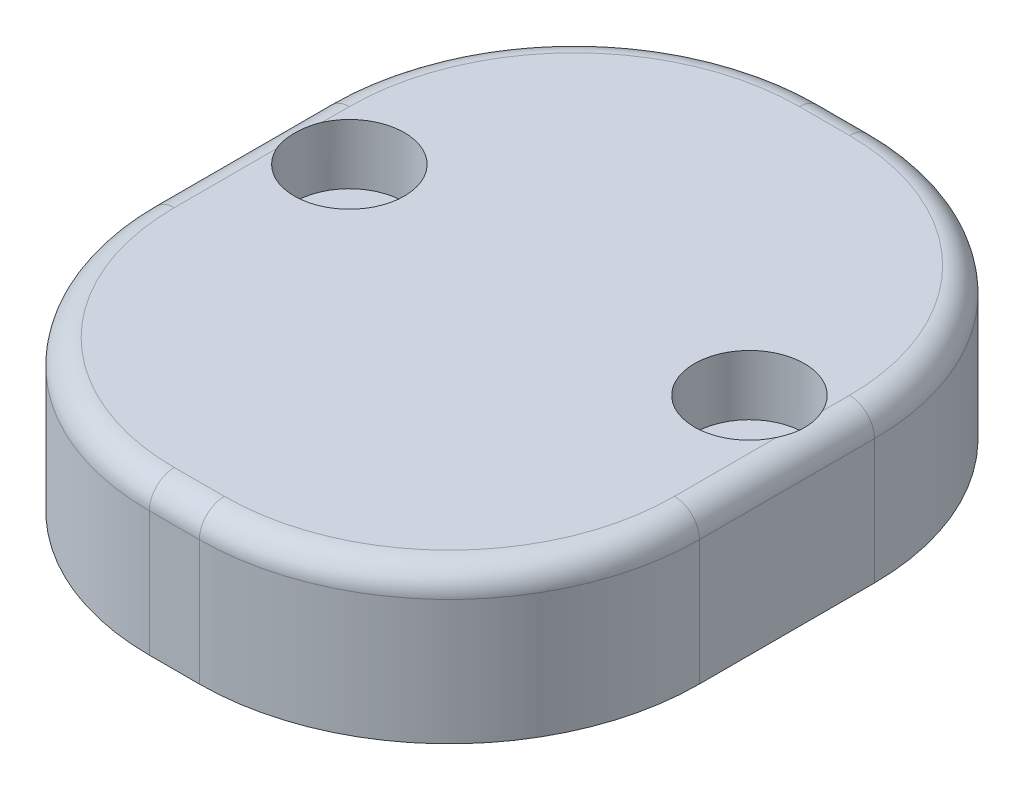
ISO-10303-21;
HEADER;
FILE_DESCRIPTION(('STEP AP214'),'2;1');
FILE_NAME('part.step','',(''),(''),'','','');
FILE_SCHEMA(('AUTOMOTIVE_DESIGN { 1 0 10303 214 1 1 1 1 }'));
ENDSEC;
DATA;
#1=APPLICATION_CONTEXT('core data for automotive mechanical design processes');
#2=APPLICATION_PROTOCOL_DEFINITION('international standard','automotive_design',2000,#1);
#3=PRODUCT_CONTEXT('',#1,'mechanical');
#4=PRODUCT('Part','Part','',(#3));
#5=PRODUCT_RELATED_PRODUCT_CATEGORY('part','',(#4));
#6=PRODUCT_DEFINITION_FORMATION('','',#4);
#7=PRODUCT_DEFINITION_CONTEXT('part definition',#1,'design');
#8=PRODUCT_DEFINITION('design','',#6,#7);
#9=PRODUCT_DEFINITION_SHAPE('','',#8);
#10=(LENGTH_UNIT() NAMED_UNIT(*) SI_UNIT(.MILLI.,.METRE.));
#11=(NAMED_UNIT(*) PLANE_ANGLE_UNIT() SI_UNIT($,.RADIAN.));
#12=(NAMED_UNIT(*) SI_UNIT($,.STERADIAN.) SOLID_ANGLE_UNIT());
#13=UNCERTAINTY_MEASURE_WITH_UNIT(LENGTH_MEASURE(1.E-05),#10,'distance_accuracy_value','');
#14=(GEOMETRIC_REPRESENTATION_CONTEXT(3) GLOBAL_UNCERTAINTY_ASSIGNED_CONTEXT((#13)) GLOBAL_UNIT_ASSIGNED_CONTEXT((#10,
#11,#12)) REPRESENTATION_CONTEXT('',''));
#15=CARTESIAN_POINT('',(0.,0.,0.));
#16=DIRECTION('',(0.,0.,1.));
#17=DIRECTION('',(1.,0.,0.));
#18=AXIS2_PLACEMENT_3D('',#15,#16,#17);
#19=CARTESIAN_POINT('',(0.,0.,0.));
#20=DIRECTION('',(0.,0.,1.));
#21=DIRECTION('',(1.,0.,0.));
#22=AXIS2_PLACEMENT_3D('',#19,#20,#21);
#23=PLANE('',#22);
#24=DIRECTION('',(0.,1.,0.));
#25=VECTOR('',#24,1.);
#26=CARTESIAN_POINT('',(10.,6.,0.));
#27=LINE('',#26,#25);
#28=CARTESIAN_POINT('',(10.,4.89897948556636,0.));
#29=VERTEX_POINT('',#28);
#30=CARTESIAN_POINT('',(10.,5.,0.));
#31=VERTEX_POINT('',#30);
#32=EDGE_CURVE('E191',#29,#31,#27,.T.);
#33=ORIENTED_EDGE('',*,*,#32,.T.);
#34=DIRECTION('',(1.,0.,0.));
#35=VECTOR('',#34,1.);
#36=CARTESIAN_POINT('',(12.,5.,0.));
#37=LINE('',#36,#35);
#38=CARTESIAN_POINT('',(11.,5.,0.));
#39=VERTEX_POINT('',#38);
#40=EDGE_CURVE('E271',#31,#39,#37,.T.);
#41=ORIENTED_EDGE('',*,*,#40,.T.);
#42=CARTESIAN_POINT('',(11.,0.,0.));
#43=DIRECTION('',(0.,0.,1.));
#44=DIRECTION('',(1.,0.,0.));
#45=AXIS2_PLACEMENT_3D('',#42,#43,#44);
#46=CIRCLE('',#45,5.);
#47=EDGE_CURVE('E168',#29,#39,#46,.F.);
#48=ORIENTED_EDGE('',*,*,#47,.F.);
#49=EDGE_LOOP('',(#33,#41,#48));
#50=FACE_BOUND('',#49,.T.);
#51=ADVANCED_FACE('F32',(#50),#23,.F.);
#52=CARTESIAN_POINT('',(11.,0.,22.));
#53=DIRECTION('',(0.,0.,-1.));
#54=DIRECTION('',(-1.,0.,0.));
#55=AXIS2_PLACEMENT_3D('',#52,#53,#54);
#56=CYLINDRICAL_SURFACE('',#55,5.);
#57=DIRECTION('',(0.,0.,-1.));
#58=VECTOR('',#57,1.);
#59=CARTESIAN_POINT('',(6.,0.,22.));
#60=LINE('',#59,#58);
#61=CARTESIAN_POINT('',(6.,0.,22.));
#62=VERTEX_POINT('',#61);
#63=CARTESIAN_POINT('',(6.,0.,0.834848610088321));
#64=VERTEX_POINT('',#63);
#65=EDGE_CURVE('E160',#62,#64,#60,.T.);
#66=ORIENTED_EDGE('',*,*,#65,.T.);
#67=CARTESIAN_POINT('',(6.,0.,0.834848610088321));
#68=CARTESIAN_POINT('',(5.99997867187738,0.135011845033446,0.834882018948806));
#69=CARTESIAN_POINT('',(6.00546746244243,0.270010557183533,0.832463030257463));
#70=CARTESIAN_POINT('',(6.0273036116272,0.538906984847514,0.82296657021474));
#71=CARTESIAN_POINT('',(6.04364641369319,0.672805138510441,0.815891053702076));
#72=CARTESIAN_POINT('',(6.08694176524044,0.93800536106932,0.79736486598689));
#73=CARTESIAN_POINT('',(6.11385130062064,1.06931571634541,0.785931938020787));
#74=CARTESIAN_POINT('',(6.17799889048549,1.32898103097825,0.759138461814082));
#75=CARTESIAN_POINT('',(6.21523768152985,1.45733577886905,0.743777633488427));
#76=CARTESIAN_POINT('',(6.2996412162674,1.71007289707297,0.709714282724713));
#77=CARTESIAN_POINT('',(6.34679151482346,1.83446074821384,0.691016629336118));
#78=CARTESIAN_POINT('',(6.45066344419621,2.07874315416516,0.650919566211288));
#79=CARTESIAN_POINT('',(6.50738867032313,2.19863600039304,0.629519142368764));
#80=CARTESIAN_POINT('',(6.69138039763596,2.55065991663144,0.562302920265389));
#81=CARTESIAN_POINT('',(6.83246766867098,2.77515039770592,0.513470148602644));
#82=CARTESIAN_POINT('',(7.1564694231924,3.21008706511323,0.411226797712404));
#83=CARTESIAN_POINT('',(7.34120934875028,3.41915137620118,0.357710877119809));
#84=CARTESIAN_POINT('',(7.64283316769946,3.70794894262942,0.281225043641196));
#85=CARTESIAN_POINT('',(7.74755685338337,3.80014759496294,0.256342104162777));
#86=CARTESIAN_POINT('',(7.96462514598613,3.97567035613554,0.208699057654279));
#87=CARTESIAN_POINT('',(8.07696676447299,4.05899791241655,0.185938126410237));
#88=CARTESIAN_POINT('',(8.31112881266445,4.21786973870763,0.142911601921965));
#89=CARTESIAN_POINT('',(8.43310154925899,4.29320706490404,0.122710511282571));
#90=CARTESIAN_POINT('',(8.68347126805493,4.43331222756631,0.0862347494353322));
#91=CARTESIAN_POINT('',(8.81186521516233,4.49808499699451,0.0699582439928226));
#92=CARTESIAN_POINT('',(9.07387178505899,4.61634532323629,0.0421084282489397));
#93=CARTESIAN_POINT('',(9.20747142306811,4.66985906491516,0.0305241459201425));
#94=CARTESIAN_POINT('',(9.47903775417308,4.76522326674506,0.0126539151737671));
#95=CARTESIAN_POINT('',(9.61700084044304,4.80708309321236,0.0063637036076295));
#96=CARTESIAN_POINT('',(9.79687154728861,4.85326917813204,0.00198147055236757));
#97=CARTESIAN_POINT('',(9.83735341458672,4.86312562393378,0.00124020583946215));
#98=CARTESIAN_POINT('',(9.91852063678993,4.88181658890864,0.000249786474286768));
#99=CARTESIAN_POINT('',(9.95920577997313,4.89065200450769,1.97011901891483E-07));
#100=CARTESIAN_POINT('',(10.,4.89897948556636,0.));
#101=B_SPLINE_CURVE_WITH_KNOTS('',3,(#67,#68,#69,#70,#71,#72,#73,#74,#75,#76,#77,#78,#79,#80,
#81,#82,#83,#84,#85,#86,#87,#88,#89,#90,#91,#92,#93,#94,#95,#96,#97,#98,#99,#100),.UNSPECIFIED.,
.F.,.F.,(4,2,2,2,2,2,2,2,2,2,2,2,2,2,2,2,4),(0.,0.404881690591231,0.809593517715284,
1.21267468031032,1.6157845932544,2.01831103288909,2.42098895565289,3.22630049164659,
4.07444094444146,4.49921419060271,4.92382175621481,5.35759888778723,5.79117289011644,
6.22372711209933,6.65593267760133,6.78093528552342,6.90582729841),.UNSPECIFIED.);
#102=EDGE_CURVE('E213',#64,#29,#101,.T.);
#103=ORIENTED_EDGE('',*,*,#102,.T.);
#104=ORIENTED_EDGE('',*,*,#47,.T.);
#105=CARTESIAN_POINT('',(12.,4.89897948556636,0.));
#106=VERTEX_POINT('',#105);
#107=EDGE_CURVE('E176',#39,#106,#46,.F.);
#108=ORIENTED_EDGE('',*,*,#107,.T.);
#109=CARTESIAN_POINT('',(12.,4.89897948556636,0.));
#110=CARTESIAN_POINT('',(12.1322032583834,4.87201440791222,-2.14329301021152E-05));
#111=CARTESIAN_POINT('',(12.2632817786647,4.83966390255237,0.0026210772666264));
#112=CARTESIAN_POINT('',(12.5221637065431,4.76456920101274,0.012807986322809));
#113=CARTESIAN_POINT('',(12.6499687294982,4.72183024482699,0.0203499170843514));
#114=CARTESIAN_POINT('',(12.9009022287471,4.62650199462219,0.039870763241075));
#115=CARTESIAN_POINT('',(13.0240475964267,4.57395342911886,0.0518315261982716));
#116=CARTESIAN_POINT('',(13.265360329098,4.45937262791172,0.0796352779055718));
#117=CARTESIAN_POINT('',(13.3835272001646,4.39733945403671,0.0954786507980635));
#118=CARTESIAN_POINT('',(13.7290562348091,4.19794694565129,0.147872954381521));
#119=CARTESIAN_POINT('',(13.9480606298654,4.04705970582392,0.189340943626381));
#120=CARTESIAN_POINT('',(14.3586104835474,3.71347505726727,0.279847902943476));
#121=CARTESIAN_POINT('',(14.550127808398,3.53074547451764,0.328894524855925));
#122=CARTESIAN_POINT('',(14.9118890352833,3.12647082880639,0.431394504019483));
#123=CARTESIAN_POINT('',(15.0803032775626,2.90330913059372,0.484939834020765));
#124=CARTESIAN_POINT('',(15.3782195431659,2.43086293163413,0.586576785252228));
#125=CARTESIAN_POINT('',(15.5077030843076,2.1815660988498,0.634665809400884));
#126=CARTESIAN_POINT('',(15.6705504775165,1.79065148045435,0.697823053148833));
#127=CARTESIAN_POINT('',(15.719898856655,1.65623845449805,0.717513784014776));
#128=CARTESIAN_POINT('',(15.8069961070902,1.38321419059191,0.752892259267276));
#129=CARTESIAN_POINT('',(15.8447503790763,1.24460494045593,0.768581866851002));
#130=CARTESIAN_POINT('',(15.908180059381,0.964546007225919,0.795256124157805));
#131=CARTESIAN_POINT('',(15.9338823337092,0.823103381836048,0.806251233791758));
#132=CARTESIAN_POINT('',(15.9730136005027,0.538297729866727,0.823092907288587));
#133=CARTESIAN_POINT('',(15.9864520818861,0.394936275251337,0.828943451550562));
#134=CARTESIAN_POINT('',(15.9957891902516,0.209406770232198,0.833011982947895));
#135=CARTESIAN_POINT('',(15.9973688350891,0.167521864295987,0.833700727781765));
#136=CARTESIAN_POINT('',(15.9994735454067,0.0837597007614819,0.834618717628923));
#137=CARTESIAN_POINT('',(15.9999995950335,0.0418824725949628,0.834848391452833));
#138=CARTESIAN_POINT('',(16.,0.,0.834848610088265));
#139=B_SPLINE_CURVE_WITH_KNOTS('',3,(#109,#110,#111,#112,#113,#114,#115,#116,#117,#118,#119,
#120,#121,#122,#123,#124,#125,#126,#127,#128,#129,#130,#131,#132,#133,#134,#135,#136,#137,#138),
.UNSPECIFIED.,.F.,.F.,(4,2,2,2,2,2,2,2,2,2,2,2,2,2,4),(0.,0.404599235286033,0.80899481037096,
1.21174728420965,1.61453962216218,2.41817085710597,3.22261885287953,4.07282394175045,
4.92343202678592,5.35655012939949,5.78946617273127,6.22141252807982,6.65302438762456,
6.7787749103284,6.90440791655807),.UNSPECIFIED.);
#140=CARTESIAN_POINT('',(16.,0.,0.834848610088321));
#141=VERTEX_POINT('',#140);
#142=EDGE_CURVE('E156',#106,#141,#139,.T.);
#143=ORIENTED_EDGE('',*,*,#142,.T.);
#144=DIRECTION('',(0.,0.,-1.));
#145=VECTOR('',#144,1.);
#146=CARTESIAN_POINT('',(16.,0.,22.));
#147=LINE('',#146,#145);
#148=CARTESIAN_POINT('',(16.,0.,22.));
#149=VERTEX_POINT('',#148);
#150=EDGE_CURVE('E149',#149,#141,#147,.T.);
#151=ORIENTED_EDGE('',*,*,#150,.F.);
#152=CARTESIAN_POINT('',(11.,0.,22.));
#153=DIRECTION('',(0.,0.,1.));
#154=DIRECTION('',(1.,0.,0.));
#155=AXIS2_PLACEMENT_3D('',#152,#153,#154);
#156=CIRCLE('',#155,5.);
#157=EDGE_CURVE('E153',#62,#149,#156,.F.);
#158=ORIENTED_EDGE('',*,*,#157,.F.);
#159=EDGE_LOOP('',(#66,#103,#104,#108,#143,#151,#158));
#160=FACE_BOUND('',#159,.T.);
#161=ADVANCED_FACE('F152',(#160),#56,.F.);
#162=CARTESIAN_POINT('',(0.,0.,22.));
#163=DIRECTION('',(0.,1.,0.));
#164=DIRECTION('',(0.,0.,1.));
#165=AXIS2_PLACEMENT_3D('',#162,#163,#164);
#166=PLANE('',#165);
#167=CARTESIAN_POINT('',(19.,0.,12.));
#168=DIRECTION('',(0.,1.,0.));
#169=DIRECTION('',(0.,0.,1.));
#170=AXIS2_PLACEMENT_3D('',#167,#168,#169);
#171=CIRCLE('',#170,1.20000000000001);
#172=CARTESIAN_POINT('',(19.,0.,13.2));
#173=VERTEX_POINT('',#172);
#174=EDGE_CURVE('E363',#173,#173,#171,.T.);
#175=ORIENTED_EDGE('',*,*,#174,.T.);
#176=EDGE_LOOP('',(#175));
#177=FACE_BOUND('',#176,.T.);
#178=CARTESIAN_POINT('',(3.,0.,12.));
#179=DIRECTION('',(0.,1.,0.));
#180=DIRECTION('',(0.,0.,1.));
#181=AXIS2_PLACEMENT_3D('',#178,#179,#180);
#182=CIRCLE('',#181,1.20000000000001);
#183=CARTESIAN_POINT('',(3.,0.,13.2));
#184=VERTEX_POINT('',#183);
#185=EDGE_CURVE('E173',#184,#184,#182,.T.);
#186=ORIENTED_EDGE('',*,*,#185,.T.);
#187=EDGE_LOOP('',(#186));
#188=FACE_BOUND('',#187,.T.);
#189=DIRECTION('',(0.,0.,-1.));
#190=VECTOR('',#189,1.);
#191=CARTESIAN_POINT('',(0.,0.,22.));
#192=LINE('',#191,#190);
#193=CARTESIAN_POINT('',(0.,0.,17.));
#194=VERTEX_POINT('',#193);
#195=CARTESIAN_POINT('',(0.,0.,10.));
#196=VERTEX_POINT('',#195);
#197=EDGE_CURVE('E167',#194,#196,#192,.T.);
#198=ORIENTED_EDGE('',*,*,#197,.T.);
#199=CARTESIAN_POINT('',(10.,0.,10.));
#200=DIRECTION('',(0.,1.,0.));
#201=DIRECTION('',(0.,0.,1.));
#202=AXIS2_PLACEMENT_3D('',#199,#200,#201);
#203=CIRCLE('',#202,10.);
#204=EDGE_CURVE('E205',#196,#64,#203,.F.);
#205=ORIENTED_EDGE('',*,*,#204,.T.);
#206=ORIENTED_EDGE('',*,*,#65,.F.);
#207=DIRECTION('',(1.,0.,0.));
#208=VECTOR('',#207,1.);
#209=CARTESIAN_POINT('',(0.,0.,22.));
#210=LINE('',#209,#208);
#211=EDGE_CURVE('E166',#62,#149,#210,.T.);
#212=ORIENTED_EDGE('',*,*,#211,.T.);
#213=ORIENTED_EDGE('',*,*,#150,.T.);
#214=CARTESIAN_POINT('',(12.,0.,10.));
#215=DIRECTION('',(0.,1.,0.));
#216=DIRECTION('',(0.,0.,1.));
#217=AXIS2_PLACEMENT_3D('',#214,#215,#216);
#218=CIRCLE('',#217,10.);
#219=CARTESIAN_POINT('',(22.,0.,10.));
#220=VERTEX_POINT('',#219);
#221=EDGE_CURVE('E201',#141,#220,#218,.F.);
#222=ORIENTED_EDGE('',*,*,#221,.T.);
#223=DIRECTION('',(0.,0.,-1.));
#224=VECTOR('',#223,1.);
#225=CARTESIAN_POINT('',(22.,0.,22.));
#226=LINE('',#225,#224);
#227=CARTESIAN_POINT('',(22.,0.,17.));
#228=VERTEX_POINT('',#227);
#229=EDGE_CURVE('E161',#228,#220,#226,.T.);
#230=ORIENTED_EDGE('',*,*,#229,.F.);
#231=CARTESIAN_POINT('',(12.,0.,17.));
#232=DIRECTION('',(0.,1.,0.));
#233=DIRECTION('',(0.,0.,1.));
#234=AXIS2_PLACEMENT_3D('',#231,#232,#233);
#235=CIRCLE('',#234,10.);
#236=CARTESIAN_POINT('',(12.,0.,27.));
#237=VERTEX_POINT('',#236);
#238=EDGE_CURVE('E199',#228,#237,#235,.F.);
#239=ORIENTED_EDGE('',*,*,#238,.T.);
#240=DIRECTION('',(1.,0.,0.));
#241=VECTOR('',#240,1.);
#242=CARTESIAN_POINT('',(0.,0.,27.));
#243=LINE('',#242,#241);
#244=CARTESIAN_POINT('',(10.,0.,27.));
#245=VERTEX_POINT('',#244);
#246=EDGE_CURVE('E172',#245,#237,#243,.T.);
#247=ORIENTED_EDGE('',*,*,#246,.F.);
#248=CARTESIAN_POINT('',(10.,0.,17.));
#249=DIRECTION('',(0.,1.,0.));
#250=DIRECTION('',(0.,0.,1.));
#251=AXIS2_PLACEMENT_3D('',#248,#249,#250);
#252=CIRCLE('',#251,10.);
#253=EDGE_CURVE('E203',#245,#194,#252,.F.);
#254=ORIENTED_EDGE('',*,*,#253,.T.);
#255=EDGE_LOOP('',(#198,#205,#206,#212,#213,#222,#230,#239,#247,#254));
#256=FACE_BOUND('',#255,.T.);
#257=ADVANCED_FACE('F171',(#177,#188,#256),#166,.F.);
#258=CARTESIAN_POINT('',(22.,0.,22.));
#259=DIRECTION('',(-1.,0.,0.));
#260=DIRECTION('',(0.,0.,1.));
#261=AXIS2_PLACEMENT_3D('',#258,#259,#260);
#262=PLANE('',#261);
#263=DIRECTION('',(0.,1.,0.));
#264=VECTOR('',#263,1.);
#265=CARTESIAN_POINT('',(22.,0.,10.));
#266=LINE('',#265,#264);
#267=CARTESIAN_POINT('',(22.,5.,10.));
#268=VERTEX_POINT('',#267);
#269=EDGE_CURVE('E446',#220,#268,#266,.T.);
#270=ORIENTED_EDGE('',*,*,#269,.T.);
#271=DIRECTION('',(0.,0.,-1.));
#272=VECTOR('',#271,1.);
#273=CARTESIAN_POINT('',(22.,5.,17.));
#274=LINE('',#273,#272);
#275=CARTESIAN_POINT('',(22.,5.,17.));
#276=VERTEX_POINT('',#275);
#277=EDGE_CURVE('E280',#268,#276,#274,.F.);
#278=ORIENTED_EDGE('',*,*,#277,.T.);
#279=DIRECTION('',(0.,1.,0.));
#280=VECTOR('',#279,1.);
#281=CARTESIAN_POINT('',(22.,0.,17.));
#282=LINE('',#281,#280);
#283=EDGE_CURVE('E449',#276,#228,#282,.F.);
#284=ORIENTED_EDGE('',*,*,#283,.T.);
#285=ORIENTED_EDGE('',*,*,#229,.T.);
#286=EDGE_LOOP('',(#270,#278,#284,#285));
#287=FACE_BOUND('',#286,.T.);
#288=ADVANCED_FACE('F434',(#287),#262,.F.);
#289=CARTESIAN_POINT('',(0.,6.,22.));
#290=DIRECTION('',(0.,1.,0.));
#291=DIRECTION('',(0.,0.,1.));
#292=AXIS2_PLACEMENT_3D('',#289,#290,#291);
#293=PLANE('',#292);
#294=CARTESIAN_POINT('',(19.,6.,12.));
#295=DIRECTION('',(0.,1.,0.));
#296=DIRECTION('',(0.,0.,1.));
#297=AXIS2_PLACEMENT_3D('',#294,#295,#296);
#298=CIRCLE('',#297,2.19999999999999);
#299=CARTESIAN_POINT('',(21.,6.,11.0834848610088));
#300=VERTEX_POINT('',#299);
#301=CARTESIAN_POINT('',(21.,6.,12.9165151389912));
#302=VERTEX_POINT('',#301);
#303=EDGE_CURVE('E347',#300,#302,#298,.T.);
#304=ORIENTED_EDGE('',*,*,#303,.F.);
#305=DIRECTION('',(0.,0.,-1.));
#306=VECTOR('',#305,1.);
#307=CARTESIAN_POINT('',(21.,6.,10.));
#308=LINE('',#307,#306);
#309=CARTESIAN_POINT('',(21.,6.,10.));
#310=VERTEX_POINT('',#309);
#311=EDGE_CURVE('E403',#300,#310,#308,.T.);
#312=ORIENTED_EDGE('',*,*,#311,.T.);
#313=CARTESIAN_POINT('',(12.,6.,10.));
#314=DIRECTION('',(0.,1.,0.));
#315=DIRECTION('',(0.,0.,1.));
#316=AXIS2_PLACEMENT_3D('',#313,#314,#315);
#317=CIRCLE('',#316,9.);
#318=CARTESIAN_POINT('',(12.,6.,1.));
#319=VERTEX_POINT('',#318);
#320=EDGE_CURVE('E401',#310,#319,#317,.T.);
#321=ORIENTED_EDGE('',*,*,#320,.T.);
#322=DIRECTION('',(1.,0.,0.));
#323=VECTOR('',#322,1.);
#324=CARTESIAN_POINT('',(10.,6.,1.));
#325=LINE('',#324,#323);
#326=CARTESIAN_POINT('',(10.,6.,1.));
#327=VERTEX_POINT('',#326);
#328=EDGE_CURVE('E399',#319,#327,#325,.F.);
#329=ORIENTED_EDGE('',*,*,#328,.T.);
#330=CARTESIAN_POINT('',(10.,6.,10.));
#331=DIRECTION('',(0.,1.,0.));
#332=DIRECTION('',(0.,0.,1.));
#333=AXIS2_PLACEMENT_3D('',#330,#331,#332);
#334=CIRCLE('',#333,9.);
#335=CARTESIAN_POINT('',(1.,6.,10.));
#336=VERTEX_POINT('',#335);
#337=EDGE_CURVE('E397',#327,#336,#334,.T.);
#338=ORIENTED_EDGE('',*,*,#337,.T.);
#339=DIRECTION('',(0.,0.,-1.));
#340=VECTOR('',#339,1.);
#341=CARTESIAN_POINT('',(1.,6.,22.));
#342=LINE('',#341,#340);
#343=CARTESIAN_POINT('',(1.,6.,11.0834848610088));
#344=VERTEX_POINT('',#343);
#345=EDGE_CURVE('E384',#336,#344,#342,.F.);
#346=ORIENTED_EDGE('',*,*,#345,.T.);
#347=CARTESIAN_POINT('',(3.,6.,12.));
#348=DIRECTION('',(0.,1.,0.));
#349=DIRECTION('',(0.,0.,1.));
#350=AXIS2_PLACEMENT_3D('',#347,#348,#349);
#351=CIRCLE('',#350,2.19999999999999);
#352=CARTESIAN_POINT('',(1.,6.,12.9165151389912));
#353=VERTEX_POINT('',#352);
#354=EDGE_CURVE('E366',#353,#344,#351,.T.);
#355=ORIENTED_EDGE('',*,*,#354,.F.);
#356=DIRECTION('',(0.,0.,-1.));
#357=VECTOR('',#356,1.);
#358=CARTESIAN_POINT('',(1.,6.,22.));
#359=LINE('',#358,#357);
#360=CARTESIAN_POINT('',(1.,6.,17.));
#361=VERTEX_POINT('',#360);
#362=EDGE_CURVE('E385',#353,#361,#359,.F.);
#363=ORIENTED_EDGE('',*,*,#362,.T.);
#364=CARTESIAN_POINT('',(10.,6.,17.));
#365=DIRECTION('',(0.,1.,0.));
#366=DIRECTION('',(0.,0.,1.));
#367=AXIS2_PLACEMENT_3D('',#364,#365,#366);
#368=CIRCLE('',#367,9.);
#369=CARTESIAN_POINT('',(10.,6.,26.));
#370=VERTEX_POINT('',#369);
#371=EDGE_CURVE('E388',#361,#370,#368,.T.);
#372=ORIENTED_EDGE('',*,*,#371,.T.);
#373=DIRECTION('',(-1.,0.,0.));
#374=VECTOR('',#373,1.);
#375=CARTESIAN_POINT('',(12.,6.,26.));
#376=LINE('',#375,#374);
#377=CARTESIAN_POINT('',(12.,6.,26.));
#378=VERTEX_POINT('',#377);
#379=EDGE_CURVE('E392',#370,#378,#376,.F.);
#380=ORIENTED_EDGE('',*,*,#379,.T.);
#381=CARTESIAN_POINT('',(12.,6.,17.));
#382=DIRECTION('',(0.,1.,0.));
#383=DIRECTION('',(0.,0.,1.));
#384=AXIS2_PLACEMENT_3D('',#381,#382,#383);
#385=CIRCLE('',#384,9.);
#386=CARTESIAN_POINT('',(21.,6.,17.));
#387=VERTEX_POINT('',#386);
#388=EDGE_CURVE('E332',#378,#387,#385,.T.);
#389=ORIENTED_EDGE('',*,*,#388,.T.);
#390=DIRECTION('',(0.,0.,-1.));
#391=VECTOR('',#390,1.);
#392=CARTESIAN_POINT('',(21.,6.,10.));
#393=LINE('',#392,#391);
#394=EDGE_CURVE('E387',#387,#302,#393,.T.);
#395=ORIENTED_EDGE('',*,*,#394,.T.);
#396=EDGE_LOOP('',(#304,#312,#321,#329,#338,#346,#355,#363,#372,#380,#389,#395));
#397=FACE_BOUND('',#396,.T.);
#398=ADVANCED_FACE('F257',(#397),#293,.T.);
#399=CARTESIAN_POINT('',(0.,0.,22.));
#400=DIRECTION('',(-1.,0.,0.));
#401=DIRECTION('',(0.,0.,1.));
#402=AXIS2_PLACEMENT_3D('',#399,#400,#401);
#403=PLANE('',#402);
#404=DIRECTION('',(0.,-1.,0.));
#405=VECTOR('',#404,1.);
#406=CARTESIAN_POINT('',(0.,6.,17.));
#407=LINE('',#406,#405);
#408=CARTESIAN_POINT('',(0.,5.,17.));
#409=VERTEX_POINT('',#408);
#410=EDGE_CURVE('E194',#194,#409,#407,.F.);
#411=ORIENTED_EDGE('',*,*,#410,.T.);
#412=DIRECTION('',(0.,0.,-1.));
#413=VECTOR('',#412,1.);
#414=CARTESIAN_POINT('',(0.,5.,22.));
#415=LINE('',#414,#413);
#416=CARTESIAN_POINT('',(0.,5.,10.));
#417=VERTEX_POINT('',#416);
#418=EDGE_CURVE('E285',#409,#417,#415,.T.);
#419=ORIENTED_EDGE('',*,*,#418,.T.);
#420=DIRECTION('',(0.,1.,0.));
#421=VECTOR('',#420,1.);
#422=CARTESIAN_POINT('',(0.,0.,10.));
#423=LINE('',#422,#421);
#424=EDGE_CURVE('E197',#417,#196,#423,.F.);
#425=ORIENTED_EDGE('',*,*,#424,.T.);
#426=ORIENTED_EDGE('',*,*,#197,.F.);
#427=EDGE_LOOP('',(#411,#419,#425,#426));
#428=FACE_BOUND('',#427,.T.);
#429=ADVANCED_FACE('F250',(#428),#403,.T.);
#430=ORIENTED_EDGE('',*,*,#107,.F.);
#431=DIRECTION('',(1.,0.,0.));
#432=VECTOR('',#431,1.);
#433=CARTESIAN_POINT('',(12.,5.,0.));
#434=LINE('',#433,#432);
#435=CARTESIAN_POINT('',(12.,5.,0.));
#436=VERTEX_POINT('',#435);
#437=EDGE_CURVE('E261',#39,#436,#434,.T.);
#438=ORIENTED_EDGE('',*,*,#437,.T.);
#439=DIRECTION('',(0.,1.,0.));
#440=VECTOR('',#439,1.);
#441=CARTESIAN_POINT('',(12.,0.,0.));
#442=LINE('',#441,#440);
#443=EDGE_CURVE('E188',#436,#106,#442,.F.);
#444=ORIENTED_EDGE('',*,*,#443,.T.);
#445=EDGE_LOOP('',(#430,#438,#444));
#446=FACE_BOUND('',#445,.T.);
#447=ADVANCED_FACE('F244',(#446),#23,.F.);
#448=CARTESIAN_POINT('',(0.,0.,22.));
#449=DIRECTION('',(0.,0.,-1.));
#450=DIRECTION('',(-1.,0.,0.));
#451=AXIS2_PLACEMENT_3D('',#448,#449,#450);
#452=PLANE('',#451);
#453=ORIENTED_EDGE('',*,*,#211,.F.);
#454=ORIENTED_EDGE('',*,*,#157,.T.);
#455=EDGE_LOOP('',(#453,#454));
#456=FACE_BOUND('',#455,.T.);
#457=ADVANCED_FACE('F165',(#456),#452,.T.);
#458=CARTESIAN_POINT('',(0.,0.,27.));
#459=DIRECTION('',(0.,0.,-1.));
#460=DIRECTION('',(-1.,0.,0.));
#461=AXIS2_PLACEMENT_3D('',#458,#459,#460);
#462=PLANE('',#461);
#463=DIRECTION('',(0.,1.,0.));
#464=VECTOR('',#463,1.);
#465=CARTESIAN_POINT('',(12.,0.,27.));
#466=LINE('',#465,#464);
#467=CARTESIAN_POINT('',(12.,5.,27.));
#468=VERTEX_POINT('',#467);
#469=EDGE_CURVE('E314',#237,#468,#466,.T.);
#470=ORIENTED_EDGE('',*,*,#469,.T.);
#471=DIRECTION('',(-1.,0.,0.));
#472=VECTOR('',#471,1.);
#473=CARTESIAN_POINT('',(10.,5.,27.));
#474=LINE('',#473,#472);
#475=CARTESIAN_POINT('',(10.,5.,27.));
#476=VERTEX_POINT('',#475);
#477=EDGE_CURVE('E42',#468,#476,#474,.T.);
#478=ORIENTED_EDGE('',*,*,#477,.T.);
#479=DIRECTION('',(0.,-1.,0.));
#480=VECTOR('',#479,1.);
#481=CARTESIAN_POINT('',(10.,0.,27.));
#482=LINE('',#481,#480);
#483=EDGE_CURVE('E317',#476,#245,#482,.T.);
#484=ORIENTED_EDGE('',*,*,#483,.T.);
#485=ORIENTED_EDGE('',*,*,#246,.T.);
#486=EDGE_LOOP('',(#470,#478,#484,#485));
#487=FACE_BOUND('',#486,.T.);
#488=ADVANCED_FACE('F256',(#487),#462,.F.);
#489=CARTESIAN_POINT('',(3.,6.,12.));
#490=DIRECTION('',(0.,1.,0.));
#491=DIRECTION('',(0.,0.,1.));
#492=AXIS2_PLACEMENT_3D('',#489,#490,#491);
#493=CYLINDRICAL_SURFACE('',#492,1.2);
#494=ORIENTED_EDGE('',*,*,#185,.F.);
#495=EDGE_LOOP('',(#494));
#496=FACE_BOUND('',#495,.T.);
#497=CARTESIAN_POINT('',(3.,3.6,12.));
#498=DIRECTION('',(0.,1.,0.));
#499=DIRECTION('',(0.,0.,1.));
#500=AXIS2_PLACEMENT_3D('',#497,#498,#499);
#501=CIRCLE('',#500,1.2);
#502=CARTESIAN_POINT('',(3.,3.6,13.2));
#503=VERTEX_POINT('',#502);
#504=EDGE_CURVE('E179',#503,#503,#501,.T.);
#505=ORIENTED_EDGE('',*,*,#504,.T.);
#506=EDGE_LOOP('',(#505));
#507=FACE_BOUND('',#506,.T.);
#508=ADVANCED_FACE('F306',(#496,#507),#493,.F.);
#509=CARTESIAN_POINT('',(4.2,3.6,12.));
#510=DIRECTION('',(0.,-1.,0.));
#511=DIRECTION('',(0.,0.,-1.));
#512=AXIS2_PLACEMENT_3D('',#509,#510,#511);
#513=PLANE('',#512);
#514=ORIENTED_EDGE('',*,*,#504,.F.);
#515=EDGE_LOOP('',(#514));
#516=FACE_BOUND('',#515,.T.);
#517=CARTESIAN_POINT('',(3.,3.6,12.));
#518=DIRECTION('',(0.,1.,0.));
#519=DIRECTION('',(0.,0.,1.));
#520=AXIS2_PLACEMENT_3D('',#517,#518,#519);
#521=CIRCLE('',#520,2.2);
#522=CARTESIAN_POINT('',(3.,3.6,14.2));
#523=VERTEX_POINT('',#522);
#524=EDGE_CURVE('E369',#523,#523,#521,.T.);
#525=ORIENTED_EDGE('',*,*,#524,.T.);
#526=EDGE_LOOP('',(#525));
#527=FACE_BOUND('',#526,.T.);
#528=ADVANCED_FACE('F301',(#516,#527),#513,.F.);
#529=CARTESIAN_POINT('',(3.,6.,12.));
#530=DIRECTION('',(0.,1.,0.));
#531=DIRECTION('',(0.,0.,1.));
#532=AXIS2_PLACEMENT_3D('',#529,#530,#531);
#533=CYLINDRICAL_SURFACE('',#532,2.19999999999999);
#534=ORIENTED_EDGE('',*,*,#524,.F.);
#535=EDGE_LOOP('',(#534));
#536=FACE_BOUND('',#535,.T.);
#537=ORIENTED_EDGE('',*,*,#354,.T.);
#538=CARTESIAN_POINT('',(1.,6.,11.0834848610088));
#539=CARTESIAN_POINT('',(0.974511060180868,5.99996944360789,11.1390929624444));
#540=CARTESIAN_POINT('',(0.95135907485829,5.99902483412948,11.1957516163669));
#541=CARTESIAN_POINT('',(0.909856627548534,5.99615408421632,11.3107744002441));
#542=CARTESIAN_POINT('',(0.891505789177786,5.9942280207571,11.3691383961102));
#543=CARTESIAN_POINT('',(0.859741567728135,5.990242218081,11.4871391825996));
#544=CARTESIAN_POINT('',(0.846324356394765,5.98818258397459,11.5467749482114));
#545=CARTESIAN_POINT('',(0.824495444468117,5.98454152235001,11.6669688572087));
#546=CARTESIAN_POINT('',(0.816083499687645,5.982960071505,11.7275269554496));
#547=CARTESIAN_POINT('',(0.804282991881518,5.9806789997736,11.8496130860656));
#548=CARTESIAN_POINT('',(0.800933029766176,5.97998616111959,11.911144991494));
#549=CARTESIAN_POINT('',(0.799405497365007,5.97967470502873,12.0342754871291));
#550=CARTESIAN_POINT('',(0.801227925467308,5.98005608725711,12.0958740773151));
#551=CARTESIAN_POINT('',(0.810026399416356,5.98179936113067,12.2186277563132));
#552=CARTESIAN_POINT('',(0.816997418745434,5.98316029641511,12.2797832189826));
#553=CARTESIAN_POINT('',(0.836028286098609,5.98651197068867,12.4012560432505));
#554=CARTESIAN_POINT('',(0.848086776757434,5.98850254165211,12.4615736239699));
#555=CARTESIAN_POINT('',(0.879206910107291,5.99281915459106,12.5891644886119));
#556=CARTESIAN_POINT('',(0.899000424175421,5.99515386484398,12.6562617876014));
#557=CARTESIAN_POINT('',(0.933395292000213,5.99784492750163,12.7552248006202));
#558=CARTESIAN_POINT('',(0.94563744280199,5.9986066123441,12.7879169085923));
#559=CARTESIAN_POINT('',(0.971666519422607,5.99968299761477,12.8526906200615));
#560=CARTESIAN_POINT('',(0.985453578141641,5.99999765955608,12.8847721707574));
#561=CARTESIAN_POINT('',(0.999999999999999,6.,12.9165151389912));
#562=B_SPLINE_CURVE_WITH_KNOTS('',3,(#538,#539,#540,#541,#542,#543,#544,#545,#546,#547,#548,
#549,#550,#551,#552,#553,#554,#555,#556,#557,#558,#559,#560,#561),.UNSPECIFIED.,.F.,.F.,(4,2,2,
2,2,2,2,2,2,2,2,4),(0.,0.183430039088217,0.366845693956448,0.550118725361292,0.733382814865205,
0.918037481994573,1.10269209158005,1.28716666263755,1.47159204596154,1.68122221881606,
1.78593824014754,1.89066327656581),.UNSPECIFIED.);
#563=EDGE_CURVE('E287',#344,#353,#562,.T.);
#564=ORIENTED_EDGE('',*,*,#563,.T.);
#565=EDGE_LOOP('',(#537,#564));
#566=FACE_BOUND('',#565,.T.);
#567=ADVANCED_FACE('F295',(#536,#566),#533,.F.);
#568=CARTESIAN_POINT('',(19.,6.,12.));
#569=DIRECTION('',(0.,1.,0.));
#570=DIRECTION('',(0.,0.,1.));
#571=AXIS2_PLACEMENT_3D('',#568,#569,#570);
#572=CYLINDRICAL_SURFACE('',#571,1.2);
#573=ORIENTED_EDGE('',*,*,#174,.F.);
#574=EDGE_LOOP('',(#573));
#575=FACE_BOUND('',#574,.T.);
#576=CARTESIAN_POINT('',(19.,3.6,12.));
#577=DIRECTION('',(0.,1.,0.));
#578=DIRECTION('',(0.,0.,1.));
#579=AXIS2_PLACEMENT_3D('',#576,#577,#578);
#580=CIRCLE('',#579,1.2);
#581=CARTESIAN_POINT('',(19.,3.6,13.2));
#582=VERTEX_POINT('',#581);
#583=EDGE_CURVE('E358',#582,#582,#580,.T.);
#584=ORIENTED_EDGE('',*,*,#583,.T.);
#585=EDGE_LOOP('',(#584));
#586=FACE_BOUND('',#585,.T.);
#587=ADVANCED_FACE('F300',(#575,#586),#572,.F.);
#588=CARTESIAN_POINT('',(20.2,3.6,12.));
#589=DIRECTION('',(0.,-1.,0.));
#590=DIRECTION('',(0.,0.,-1.));
#591=AXIS2_PLACEMENT_3D('',#588,#589,#590);
#592=PLANE('',#591);
#593=ORIENTED_EDGE('',*,*,#583,.F.);
#594=EDGE_LOOP('',(#593));
#595=FACE_BOUND('',#594,.T.);
#596=CARTESIAN_POINT('',(19.,3.6,12.));
#597=DIRECTION('',(0.,1.,0.));
#598=DIRECTION('',(0.,0.,1.));
#599=AXIS2_PLACEMENT_3D('',#596,#597,#598);
#600=CIRCLE('',#599,2.2);
#601=CARTESIAN_POINT('',(19.,3.6,14.2));
#602=VERTEX_POINT('',#601);
#603=EDGE_CURVE('E353',#602,#602,#600,.T.);
#604=ORIENTED_EDGE('',*,*,#603,.T.);
#605=EDGE_LOOP('',(#604));
#606=FACE_BOUND('',#605,.T.);
#607=ADVANCED_FACE('F416',(#595,#606),#592,.F.);
#608=CARTESIAN_POINT('',(19.,6.,12.));
#609=DIRECTION('',(0.,1.,0.));
#610=DIRECTION('',(0.,0.,1.));
#611=AXIS2_PLACEMENT_3D('',#608,#609,#610);
#612=CYLINDRICAL_SURFACE('',#611,2.2);
#613=ORIENTED_EDGE('',*,*,#603,.F.);
#614=EDGE_LOOP('',(#613));
#615=FACE_BOUND('',#614,.T.);
#616=ORIENTED_EDGE('',*,*,#303,.T.);
#617=CARTESIAN_POINT('',(21.,6.,12.9165151389912));
#618=CARTESIAN_POINT('',(21.0254889398191,5.99996944360789,12.8609070375556));
#619=CARTESIAN_POINT('',(21.0486409251417,5.99902483412948,12.8042483836331));
#620=CARTESIAN_POINT('',(21.0901433724515,5.99615408421632,12.689225599756));
#621=CARTESIAN_POINT('',(21.1084942108222,5.9942280207571,12.6308616038898));
#622=CARTESIAN_POINT('',(21.1402584322719,5.990242218081,12.5128608174004));
#623=CARTESIAN_POINT('',(21.1536756436052,5.98818258397459,12.4532250517886));
#624=CARTESIAN_POINT('',(21.1755045555319,5.98454152235001,12.3330311427913));
#625=CARTESIAN_POINT('',(21.1839165003124,5.982960071505,12.2724730445504));
#626=CARTESIAN_POINT('',(21.1957170081185,5.9806789997736,12.1503869139344));
#627=CARTESIAN_POINT('',(21.1990669702338,5.97998616111959,12.088855008506));
#628=CARTESIAN_POINT('',(21.200594502635,5.97967470502873,11.9657245128709));
#629=CARTESIAN_POINT('',(21.1987720745327,5.98005608725711,11.904125922685));
#630=CARTESIAN_POINT('',(21.1899736005836,5.98179936113067,11.7813722436868));
#631=CARTESIAN_POINT('',(21.1830025812546,5.98316029641511,11.7202167810174));
#632=CARTESIAN_POINT('',(21.1639717139014,5.98651197068867,11.5987439567495));
#633=CARTESIAN_POINT('',(21.1519132232426,5.98850254165211,11.5384263760302));
#634=CARTESIAN_POINT('',(21.1207930898927,5.99281915459106,11.4108355113881));
#635=CARTESIAN_POINT('',(21.1009995758246,5.99515386484398,11.3437382123986));
#636=CARTESIAN_POINT('',(21.0666047079998,5.99784492750163,11.2447751993798));
#637=CARTESIAN_POINT('',(21.054362557198,5.9986066123441,11.2120830914077));
#638=CARTESIAN_POINT('',(21.0283334805774,5.99968299761477,11.1473093799385));
#639=CARTESIAN_POINT('',(21.0145464218584,5.99999765955608,11.1152278292426));
#640=CARTESIAN_POINT('',(21.,6.,11.0834848610088));
#641=B_SPLINE_CURVE_WITH_KNOTS('',3,(#617,#618,#619,#620,#621,#622,#623,#624,#625,#626,#627,
#628,#629,#630,#631,#632,#633,#634,#635,#636,#637,#638,#639,#640),.UNSPECIFIED.,.F.,.F.,(4,2,2,
2,2,2,2,2,2,2,2,4),(0.,0.183430039088217,0.366845693956447,0.550118725361292,0.733382814865207,
0.918037481994576,1.10269209158006,1.28716666263755,1.47159204596154,1.68122221881607,
1.78593824014756,1.89066327656583),.UNSPECIFIED.);
#642=EDGE_CURVE('E405',#302,#300,#641,.T.);
#643=ORIENTED_EDGE('',*,*,#642,.T.);
#644=EDGE_LOOP('',(#616,#643));
#645=FACE_BOUND('',#644,.T.);
#646=ADVANCED_FACE('F232',(#615,#645),#612,.F.);
#647=CARTESIAN_POINT('',(10.,0.,10.));
#648=DIRECTION('',(0.,-1.,0.));
#649=DIRECTION('',(0.,0.,-1.));
#650=AXIS2_PLACEMENT_3D('',#647,#648,#649);
#651=CYLINDRICAL_SURFACE('',#650,10.);
#652=ORIENTED_EDGE('',*,*,#424,.F.);
#653=CARTESIAN_POINT('',(10.,5.,10.));
#654=DIRECTION('',(0.,1.,0.));
#655=DIRECTION('',(0.,0.,1.));
#656=AXIS2_PLACEMENT_3D('',#653,#654,#655);
#657=CIRCLE('',#656,10.);
#658=EDGE_CURVE('E278',#417,#31,#657,.F.);
#659=ORIENTED_EDGE('',*,*,#658,.T.);
#660=ORIENTED_EDGE('',*,*,#32,.F.);
#661=ORIENTED_EDGE('',*,*,#102,.F.);
#662=ORIENTED_EDGE('',*,*,#204,.F.);
#663=EDGE_LOOP('',(#652,#659,#660,#661,#662));
#664=FACE_BOUND('',#663,.T.);
#665=ADVANCED_FACE('F227',(#664),#651,.T.);
#666=CARTESIAN_POINT('',(10.,0.,17.));
#667=DIRECTION('',(0.,1.,0.));
#668=DIRECTION('',(0.,0.,1.));
#669=AXIS2_PLACEMENT_3D('',#666,#667,#668);
#670=CYLINDRICAL_SURFACE('',#669,10.);
#671=ORIENTED_EDGE('',*,*,#483,.F.);
#672=CARTESIAN_POINT('',(10.,5.,17.));
#673=DIRECTION('',(0.,1.,0.));
#674=DIRECTION('',(0.,0.,1.));
#675=AXIS2_PLACEMENT_3D('',#672,#673,#674);
#676=CIRCLE('',#675,10.);
#677=EDGE_CURVE('E293',#476,#409,#676,.F.);
#678=ORIENTED_EDGE('',*,*,#677,.T.);
#679=ORIENTED_EDGE('',*,*,#410,.F.);
#680=ORIENTED_EDGE('',*,*,#253,.F.);
#681=EDGE_LOOP('',(#671,#678,#679,#680));
#682=FACE_BOUND('',#681,.T.);
#683=ADVANCED_FACE('F231',(#682),#670,.T.);
#684=CARTESIAN_POINT('',(12.,0.,10.));
#685=DIRECTION('',(0.,1.,0.));
#686=DIRECTION('',(0.,0.,1.));
#687=AXIS2_PLACEMENT_3D('',#684,#685,#686);
#688=CYLINDRICAL_SURFACE('',#687,10.);
#689=ORIENTED_EDGE('',*,*,#443,.F.);
#690=CARTESIAN_POINT('',(12.,5.,10.));
#691=DIRECTION('',(0.,1.,0.));
#692=DIRECTION('',(0.,0.,1.));
#693=AXIS2_PLACEMENT_3D('',#690,#691,#692);
#694=CIRCLE('',#693,10.);
#695=EDGE_CURVE('E276',#436,#268,#694,.F.);
#696=ORIENTED_EDGE('',*,*,#695,.T.);
#697=ORIENTED_EDGE('',*,*,#269,.F.);
#698=ORIENTED_EDGE('',*,*,#221,.F.);
#699=ORIENTED_EDGE('',*,*,#142,.F.);
#700=EDGE_LOOP('',(#689,#696,#697,#698,#699));
#701=FACE_BOUND('',#700,.T.);
#702=ADVANCED_FACE('F219',(#701),#688,.T.);
#703=CARTESIAN_POINT('',(12.,0.,17.));
#704=DIRECTION('',(0.,1.,0.));
#705=DIRECTION('',(0.,0.,1.));
#706=AXIS2_PLACEMENT_3D('',#703,#704,#705);
#707=CYLINDRICAL_SURFACE('',#706,10.);
#708=ORIENTED_EDGE('',*,*,#283,.F.);
#709=CARTESIAN_POINT('',(12.,5.,17.));
#710=DIRECTION('',(0.,1.,0.));
#711=DIRECTION('',(0.,0.,1.));
#712=AXIS2_PLACEMENT_3D('',#709,#710,#711);
#713=CIRCLE('',#712,10.);
#714=EDGE_CURVE('E11',#276,#468,#713,.F.);
#715=ORIENTED_EDGE('',*,*,#714,.T.);
#716=ORIENTED_EDGE('',*,*,#469,.F.);
#717=ORIENTED_EDGE('',*,*,#238,.F.);
#718=EDGE_LOOP('',(#708,#715,#716,#717));
#719=FACE_BOUND('',#718,.T.);
#720=ADVANCED_FACE('F239',(#719),#707,.T.);
#721=CARTESIAN_POINT('',(1.,5.,22.));
#722=DIRECTION('',(0.,0.,-1.));
#723=DIRECTION('',(-1.,0.,0.));
#724=AXIS2_PLACEMENT_3D('',#721,#722,#723);
#725=CYLINDRICAL_SURFACE('',#724,1.);
#726=CARTESIAN_POINT('',(1.,5.,10.));
#727=DIRECTION('',(0.,0.,-1.));
#728=DIRECTION('',(-1.,0.,0.));
#729=AXIS2_PLACEMENT_3D('',#726,#727,#728);
#730=CIRCLE('',#729,1.);
#731=EDGE_CURVE('E340',#417,#336,#730,.T.);
#732=ORIENTED_EDGE('',*,*,#731,.F.);
#733=ORIENTED_EDGE('',*,*,#418,.F.);
#734=CARTESIAN_POINT('',(1.,5.,17.));
#735=DIRECTION('',(0.,0.,1.));
#736=DIRECTION('',(1.,0.,0.));
#737=AXIS2_PLACEMENT_3D('',#734,#735,#736);
#738=CIRCLE('',#737,1.);
#739=EDGE_CURVE('E37',#361,#409,#738,.T.);
#740=ORIENTED_EDGE('',*,*,#739,.F.);
#741=ORIENTED_EDGE('',*,*,#362,.F.);
#742=ORIENTED_EDGE('',*,*,#563,.F.);
#743=ORIENTED_EDGE('',*,*,#345,.F.);
#744=EDGE_LOOP('',(#732,#733,#740,#741,#742,#743));
#745=FACE_BOUND('',#744,.T.);
#746=ADVANCED_FACE('F34',(#745),#725,.T.);
#747=CARTESIAN_POINT('',(10.,5.,17.));
#748=DIRECTION('',(0.,1.,0.));
#749=DIRECTION('',(0.,0.,1.));
#750=AXIS2_PLACEMENT_3D('',#747,#748,#749);
#751=TOROIDAL_SURFACE('',#750,9.,1.);
#752=ORIENTED_EDGE('',*,*,#739,.T.);
#753=ORIENTED_EDGE('',*,*,#677,.F.);
#754=CARTESIAN_POINT('',(10.,5.,26.));
#755=DIRECTION('',(1.,0.,0.));
#756=DIRECTION('',(0.,0.,-1.));
#757=AXIS2_PLACEMENT_3D('',#754,#755,#756);
#758=CIRCLE('',#757,1.);
#759=EDGE_CURVE('E327',#370,#476,#758,.T.);
#760=ORIENTED_EDGE('',*,*,#759,.F.);
#761=ORIENTED_EDGE('',*,*,#371,.F.);
#762=EDGE_LOOP('',(#752,#753,#760,#761));
#763=FACE_BOUND('',#762,.T.);
#764=ADVANCED_FACE('F468',(#763),#751,.T.);
#765=CARTESIAN_POINT('',(10.,5.,10.));
#766=DIRECTION('',(0.,1.,0.));
#767=DIRECTION('',(0.,0.,1.));
#768=AXIS2_PLACEMENT_3D('',#765,#766,#767);
#769=TOROIDAL_SURFACE('',#768,9.,1.);
#770=ORIENTED_EDGE('',*,*,#731,.T.);
#771=ORIENTED_EDGE('',*,*,#337,.F.);
#772=CARTESIAN_POINT('',(10.,5.,1.));
#773=DIRECTION('',(1.,0.,0.));
#774=DIRECTION('',(0.,0.,-1.));
#775=AXIS2_PLACEMENT_3D('',#772,#773,#774);
#776=CIRCLE('',#775,1.);
#777=EDGE_CURVE('E333',#31,#327,#776,.T.);
#778=ORIENTED_EDGE('',*,*,#777,.F.);
#779=ORIENTED_EDGE('',*,*,#658,.F.);
#780=EDGE_LOOP('',(#770,#771,#778,#779));
#781=FACE_BOUND('',#780,.T.);
#782=ADVANCED_FACE('F462',(#781),#769,.T.);
#783=CARTESIAN_POINT('',(0.,5.,26.));
#784=DIRECTION('',(1.,0.,0.));
#785=DIRECTION('',(0.,0.,-1.));
#786=AXIS2_PLACEMENT_3D('',#783,#784,#785);
#787=CYLINDRICAL_SURFACE('',#786,1.);
#788=ORIENTED_EDGE('',*,*,#759,.T.);
#789=ORIENTED_EDGE('',*,*,#477,.F.);
#790=CARTESIAN_POINT('',(12.,5.,26.));
#791=DIRECTION('',(1.,0.,0.));
#792=DIRECTION('',(0.,0.,-1.));
#793=AXIS2_PLACEMENT_3D('',#790,#791,#792);
#794=CIRCLE('',#793,1.);
#795=EDGE_CURVE('E324',#378,#468,#794,.T.);
#796=ORIENTED_EDGE('',*,*,#795,.F.);
#797=ORIENTED_EDGE('',*,*,#379,.F.);
#798=EDGE_LOOP('',(#788,#789,#796,#797));
#799=FACE_BOUND('',#798,.T.);
#800=ADVANCED_FACE('F322',(#799),#787,.T.);
#801=CARTESIAN_POINT('',(0.,5.,1.));
#802=DIRECTION('',(-1.,0.,0.));
#803=DIRECTION('',(0.,0.,1.));
#804=AXIS2_PLACEMENT_3D('',#801,#802,#803);
#805=CYLINDRICAL_SURFACE('',#804,1.);
#806=ORIENTED_EDGE('',*,*,#777,.T.);
#807=ORIENTED_EDGE('',*,*,#328,.F.);
#808=CARTESIAN_POINT('',(12.,5.,1.));
#809=DIRECTION('',(1.,0.,0.));
#810=DIRECTION('',(0.,0.,-1.));
#811=AXIS2_PLACEMENT_3D('',#808,#809,#810);
#812=CIRCLE('',#811,1.);
#813=EDGE_CURVE('E274',#436,#319,#812,.T.);
#814=ORIENTED_EDGE('',*,*,#813,.F.);
#815=ORIENTED_EDGE('',*,*,#437,.F.);
#816=ORIENTED_EDGE('',*,*,#40,.F.);
#817=EDGE_LOOP('',(#806,#807,#814,#815,#816));
#818=FACE_BOUND('',#817,.T.);
#819=ADVANCED_FACE('F270',(#818),#805,.T.);
#820=CARTESIAN_POINT('',(12.,5.,17.));
#821=DIRECTION('',(0.,1.,0.));
#822=DIRECTION('',(0.,0.,1.));
#823=AXIS2_PLACEMENT_3D('',#820,#821,#822);
#824=TOROIDAL_SURFACE('',#823,9.,1.);
#825=ORIENTED_EDGE('',*,*,#795,.T.);
#826=ORIENTED_EDGE('',*,*,#714,.F.);
#827=CARTESIAN_POINT('',(21.,5.,17.));
#828=DIRECTION('',(0.,0.,-1.));
#829=DIRECTION('',(-1.,0.,0.));
#830=AXIS2_PLACEMENT_3D('',#827,#828,#829);
#831=CIRCLE('',#830,1.);
#832=EDGE_CURVE('E336',#387,#276,#831,.T.);
#833=ORIENTED_EDGE('',*,*,#832,.F.);
#834=ORIENTED_EDGE('',*,*,#388,.F.);
#835=EDGE_LOOP('',(#825,#826,#833,#834));
#836=FACE_BOUND('',#835,.T.);
#837=ADVANCED_FACE('F329',(#836),#824,.T.);
#838=CARTESIAN_POINT('',(12.,5.,10.));
#839=DIRECTION('',(0.,1.,0.));
#840=DIRECTION('',(0.,0.,1.));
#841=AXIS2_PLACEMENT_3D('',#838,#839,#840);
#842=TOROIDAL_SURFACE('',#841,9.,1.);
#843=ORIENTED_EDGE('',*,*,#813,.T.);
#844=ORIENTED_EDGE('',*,*,#320,.F.);
#845=CARTESIAN_POINT('',(21.,5.,10.));
#846=DIRECTION('',(0.,0.,1.));
#847=DIRECTION('',(1.,0.,0.));
#848=AXIS2_PLACEMENT_3D('',#845,#846,#847);
#849=CIRCLE('',#848,1.);
#850=EDGE_CURVE('E455',#268,#310,#849,.T.);
#851=ORIENTED_EDGE('',*,*,#850,.F.);
#852=ORIENTED_EDGE('',*,*,#695,.F.);
#853=EDGE_LOOP('',(#843,#844,#851,#852));
#854=FACE_BOUND('',#853,.T.);
#855=ADVANCED_FACE('F459',(#854),#842,.T.);
#856=CARTESIAN_POINT('',(21.,5.,22.));
#857=DIRECTION('',(0.,0.,1.));
#858=DIRECTION('',(1.,0.,0.));
#859=AXIS2_PLACEMENT_3D('',#856,#857,#858);
#860=CYLINDRICAL_SURFACE('',#859,1.);
#861=ORIENTED_EDGE('',*,*,#832,.T.);
#862=ORIENTED_EDGE('',*,*,#277,.F.);
#863=ORIENTED_EDGE('',*,*,#850,.T.);
#864=ORIENTED_EDGE('',*,*,#311,.F.);
#865=ORIENTED_EDGE('',*,*,#642,.F.);
#866=ORIENTED_EDGE('',*,*,#394,.F.);
#867=EDGE_LOOP('',(#861,#862,#863,#864,#865,#866));
#868=FACE_BOUND('',#867,.T.);
#869=ADVANCED_FACE('F411',(#868),#860,.T.);
#870=CLOSED_SHELL('',(#51,#161,#257,#288,#398,#429,#447,#457,#488,#508,#528,#567,#587,#607,#646,
#665,#683,#702,#720,#746,#764,#782,#800,#819,#837,#855,#869));
#871=MANIFOLD_SOLID_BREP('B2',#870);
#872=ADVANCED_BREP_SHAPE_REPRESENTATION('',(#18,#871),#14);
#873=SHAPE_DEFINITION_REPRESENTATION(#9,#872);
ENDSEC;
END-ISO-10303-21;
